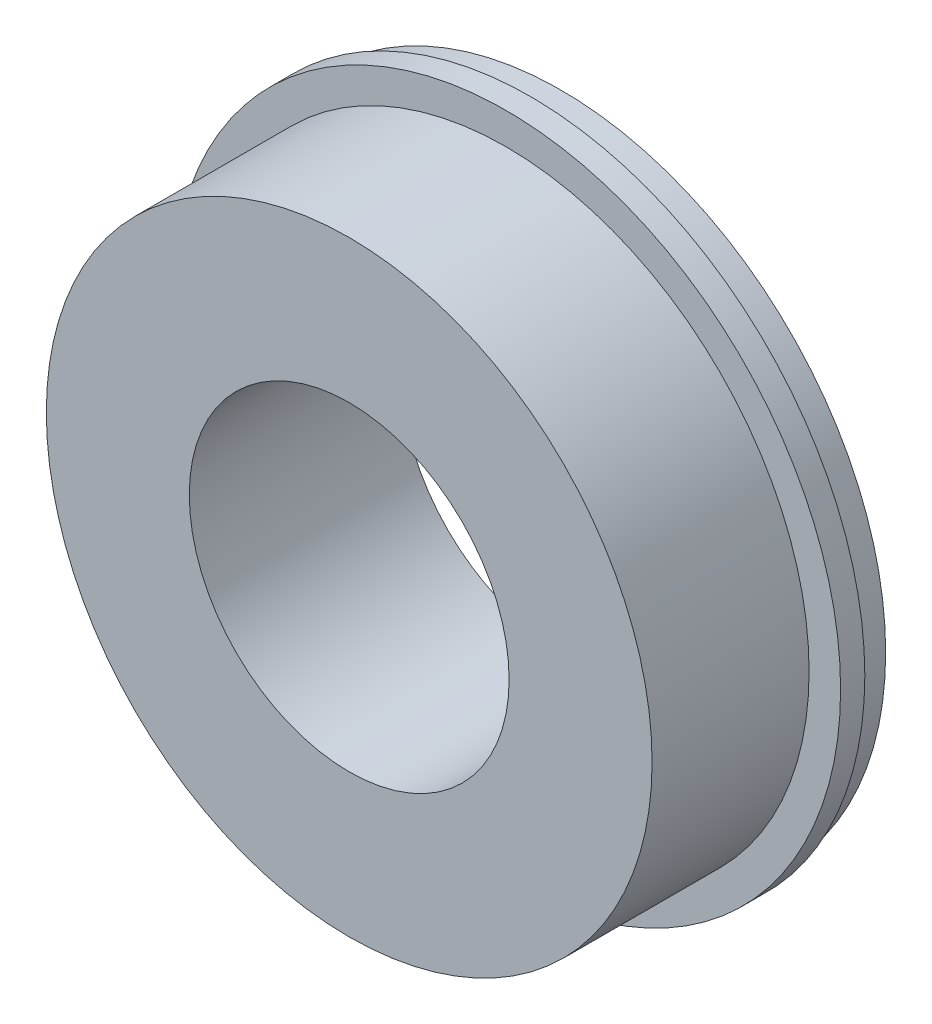
ISO-10303-21;
HEADER;
FILE_DESCRIPTION(('STEP AP214'),'2;1');
FILE_NAME('part.step','',(''),(''),'','','');
FILE_SCHEMA(('AUTOMOTIVE_DESIGN { 1 0 10303 214 1 1 1 1 }'));
ENDSEC;
DATA;
#1=APPLICATION_CONTEXT('core data for automotive mechanical design processes');
#2=APPLICATION_PROTOCOL_DEFINITION('international standard','automotive_design',2000,#1);
#3=PRODUCT_CONTEXT('',#1,'mechanical');
#4=PRODUCT('Part','Part','',(#3));
#5=PRODUCT_RELATED_PRODUCT_CATEGORY('part','',(#4));
#6=PRODUCT_DEFINITION_FORMATION('','',#4);
#7=PRODUCT_DEFINITION_CONTEXT('part definition',#1,'design');
#8=PRODUCT_DEFINITION('design','',#6,#7);
#9=PRODUCT_DEFINITION_SHAPE('','',#8);
#10=(LENGTH_UNIT() NAMED_UNIT(*) SI_UNIT(.MILLI.,.METRE.));
#11=(NAMED_UNIT(*) PLANE_ANGLE_UNIT() SI_UNIT($,.RADIAN.));
#12=(NAMED_UNIT(*) SI_UNIT($,.STERADIAN.) SOLID_ANGLE_UNIT());
#13=UNCERTAINTY_MEASURE_WITH_UNIT(LENGTH_MEASURE(1.E-05),#10,'distance_accuracy_value','');
#14=(GEOMETRIC_REPRESENTATION_CONTEXT(3) GLOBAL_UNCERTAINTY_ASSIGNED_CONTEXT((#13)) GLOBAL_UNIT_ASSIGNED_CONTEXT((#10,
#11,#12)) REPRESENTATION_CONTEXT('',''));
#15=CARTESIAN_POINT('',(0.,0.,0.));
#16=DIRECTION('',(0.,0.,1.));
#17=DIRECTION('',(1.,0.,0.));
#18=AXIS2_PLACEMENT_3D('',#15,#16,#17);
#19=CARTESIAN_POINT('',(-60.,0.,-3.7));
#20=DIRECTION('',(0.,0.,-1.));
#21=DIRECTION('',(-1.,0.,0.));
#22=AXIS2_PLACEMENT_3D('',#19,#20,#21);
#23=PLANE('',#22);
#24=CARTESIAN_POINT('',(0.,0.,-3.7));
#25=DIRECTION('',(0.,0.,1.));
#26=DIRECTION('',(1.,0.,0.));
#27=AXIS2_PLACEMENT_3D('',#24,#25,#26);
#28=CIRCLE('',#27,67.);
#29=CARTESIAN_POINT('',(67.,0.,-3.7));
#30=VERTEX_POINT('',#29);
#31=EDGE_CURVE('E10',#30,#30,#28,.T.);
#32=ORIENTED_EDGE('',*,*,#31,.F.);
#33=EDGE_LOOP('',(#32));
#34=FACE_BOUND('',#33,.T.);
#35=CARTESIAN_POINT('',(0.,0.,-3.7));
#36=DIRECTION('',(0.,0.,1.));
#37=DIRECTION('',(1.,0.,0.));
#38=AXIS2_PLACEMENT_3D('',#35,#36,#37);
#39=CIRCLE('',#38,33.);
#40=CARTESIAN_POINT('',(33.,0.,-3.7));
#41=VERTEX_POINT('',#40);
#42=EDGE_CURVE('E36',#41,#41,#39,.T.);
#43=ORIENTED_EDGE('',*,*,#42,.T.);
#44=EDGE_LOOP('',(#43));
#45=FACE_BOUND('',#44,.T.);
#46=ADVANCED_FACE('F32',(#34,#45),#23,.T.);
#47=CARTESIAN_POINT('',(0.,0.,0.));
#48=DIRECTION('',(0.,0.,1.));
#49=DIRECTION('',(1.,0.,0.));
#50=AXIS2_PLACEMENT_3D('',#47,#48,#49);
#51=CYLINDRICAL_SURFACE('',#50,67.);
#52=ORIENTED_EDGE('',*,*,#31,.T.);
#53=EDGE_LOOP('',(#52));
#54=FACE_BOUND('',#53,.T.);
#55=CARTESIAN_POINT('',(0.,0.,2.6));
#56=DIRECTION('',(0.,0.,1.));
#57=DIRECTION('',(1.,0.,0.));
#58=AXIS2_PLACEMENT_3D('',#55,#56,#57);
#59=CIRCLE('',#58,67.);
#60=CARTESIAN_POINT('',(67.,0.,2.6));
#61=VERTEX_POINT('',#60);
#62=EDGE_CURVE('E40',#61,#61,#59,.T.);
#63=ORIENTED_EDGE('',*,*,#62,.F.);
#64=EDGE_LOOP('',(#63));
#65=FACE_BOUND('',#64,.T.);
#66=ADVANCED_FACE('F76',(#54,#65),#51,.T.);
#67=CARTESIAN_POINT('',(-67.,0.,2.6));
#68=DIRECTION('',(0.,0.,-1.));
#69=DIRECTION('',(-1.,0.,0.));
#70=AXIS2_PLACEMENT_3D('',#67,#68,#69);
#71=PLANE('',#70);
#72=ORIENTED_EDGE('',*,*,#62,.T.);
#73=EDGE_LOOP('',(#72));
#74=FACE_BOUND('',#73,.T.);
#75=CARTESIAN_POINT('',(0.,0.,2.6));
#76=DIRECTION('',(0.,0.,1.));
#77=DIRECTION('',(1.,0.,0.));
#78=AXIS2_PLACEMENT_3D('',#75,#76,#77);
#79=CIRCLE('',#78,69.);
#80=CARTESIAN_POINT('',(69.,0.,2.6));
#81=VERTEX_POINT('',#80);
#82=EDGE_CURVE('E44',#81,#81,#79,.T.);
#83=ORIENTED_EDGE('',*,*,#82,.F.);
#84=EDGE_LOOP('',(#83));
#85=FACE_BOUND('',#84,.T.);
#86=ADVANCED_FACE('F81',(#74,#85),#71,.T.);
#87=CARTESIAN_POINT('',(0.,0.,0.));
#88=DIRECTION('',(0.,0.,1.));
#89=DIRECTION('',(1.,0.,0.));
#90=AXIS2_PLACEMENT_3D('',#87,#88,#89);
#91=CYLINDRICAL_SURFACE('',#90,69.);
#92=CARTESIAN_POINT('',(0.,0.,7.6));
#93=DIRECTION('',(0.,0.,-1.));
#94=DIRECTION('',(-1.,0.,0.));
#95=AXIS2_PLACEMENT_3D('',#92,#93,#94);
#96=CIRCLE('',#95,69.);
#97=CARTESIAN_POINT('',(-69.,0.,7.6));
#98=VERTEX_POINT('',#97);
#99=EDGE_CURVE('E55',#98,#98,#96,.T.);
#100=ORIENTED_EDGE('',*,*,#99,.T.);
#101=EDGE_LOOP('',(#100));
#102=FACE_BOUND('',#101,.T.);
#103=ORIENTED_EDGE('',*,*,#82,.T.);
#104=EDGE_LOOP('',(#103));
#105=FACE_BOUND('',#104,.T.);
#106=ADVANCED_FACE('F86',(#102,#105),#91,.T.);
#107=CARTESIAN_POINT('',(0.,0.,0.));
#108=DIRECTION('',(0.,0.,-1.));
#109=DIRECTION('',(-1.,0.,0.));
#110=AXIS2_PLACEMENT_3D('',#107,#108,#109);
#111=CYLINDRICAL_SURFACE('',#110,62.5);
#112=CARTESIAN_POINT('',(0.,0.,7.6));
#113=DIRECTION('',(0.,0.,-1.));
#114=DIRECTION('',(-1.,0.,0.));
#115=AXIS2_PLACEMENT_3D('',#112,#113,#114);
#116=CIRCLE('',#115,62.5);
#117=CARTESIAN_POINT('',(-62.5,0.,7.6));
#118=VERTEX_POINT('',#117);
#119=EDGE_CURVE('E52',#118,#118,#116,.T.);
#120=ORIENTED_EDGE('',*,*,#119,.F.);
#121=EDGE_LOOP('',(#120));
#122=FACE_BOUND('',#121,.T.);
#123=CARTESIAN_POINT('',(0.,0.,40.));
#124=DIRECTION('',(0.,0.,-1.));
#125=DIRECTION('',(-1.,0.,0.));
#126=AXIS2_PLACEMENT_3D('',#123,#124,#125);
#127=CIRCLE('',#126,62.5);
#128=CARTESIAN_POINT('',(-62.5,0.,40.));
#129=VERTEX_POINT('',#128);
#130=EDGE_CURVE('E49',#129,#129,#127,.T.);
#131=ORIENTED_EDGE('',*,*,#130,.T.);
#132=EDGE_LOOP('',(#131));
#133=FACE_BOUND('',#132,.T.);
#134=ADVANCED_FACE('F90',(#122,#133),#111,.T.);
#135=CARTESIAN_POINT('',(-69.,0.,7.6));
#136=DIRECTION('',(0.,0.,-1.));
#137=DIRECTION('',(-1.,0.,0.));
#138=AXIS2_PLACEMENT_3D('',#135,#136,#137);
#139=PLANE('',#138);
#140=ORIENTED_EDGE('',*,*,#99,.F.);
#141=EDGE_LOOP('',(#140));
#142=FACE_BOUND('',#141,.T.);
#143=ORIENTED_EDGE('',*,*,#119,.T.);
#144=EDGE_LOOP('',(#143));
#145=FACE_BOUND('',#144,.T.);
#146=ADVANCED_FACE('F72',(#142,#145),#139,.F.);
#147=CARTESIAN_POINT('',(0.,0.,40.));
#148=DIRECTION('',(0.,0.,1.));
#149=DIRECTION('',(1.,0.,0.));
#150=AXIS2_PLACEMENT_3D('',#147,#148,#149);
#151=PLANE('',#150);
#152=CARTESIAN_POINT('',(0.,0.,40.));
#153=DIRECTION('',(0.,0.,1.));
#154=DIRECTION('',(1.,0.,0.));
#155=AXIS2_PLACEMENT_3D('',#152,#153,#154);
#156=CIRCLE('',#155,33.);
#157=CARTESIAN_POINT('',(33.,0.,40.));
#158=VERTEX_POINT('',#157);
#159=EDGE_CURVE('E58',#158,#158,#156,.T.);
#160=ORIENTED_EDGE('',*,*,#159,.F.);
#161=EDGE_LOOP('',(#160));
#162=FACE_BOUND('',#161,.T.);
#163=ORIENTED_EDGE('',*,*,#130,.F.);
#164=EDGE_LOOP('',(#163));
#165=FACE_BOUND('',#164,.T.);
#166=ADVANCED_FACE('F34',(#162,#165),#151,.T.);
#167=CARTESIAN_POINT('',(0.,0.,0.));
#168=DIRECTION('',(0.,0.,1.));
#169=DIRECTION('',(1.,0.,0.));
#170=AXIS2_PLACEMENT_3D('',#167,#168,#169);
#171=CYLINDRICAL_SURFACE('',#170,33.);
#172=ORIENTED_EDGE('',*,*,#42,.F.);
#173=EDGE_LOOP('',(#172));
#174=FACE_BOUND('',#173,.T.);
#175=ORIENTED_EDGE('',*,*,#159,.T.);
#176=EDGE_LOOP('',(#175));
#177=FACE_BOUND('',#176,.T.);
#178=ADVANCED_FACE('F66',(#174,#177),#171,.F.);
#179=CLOSED_SHELL('',(#46,#66,#86,#106,#134,#146,#166,#178));
#180=MANIFOLD_SOLID_BREP('B2',#179);
#181=ADVANCED_BREP_SHAPE_REPRESENTATION('',(#18,#180),#14);
#182=SHAPE_DEFINITION_REPRESENTATION(#9,#181);
ENDSEC;
END-ISO-10303-21;
